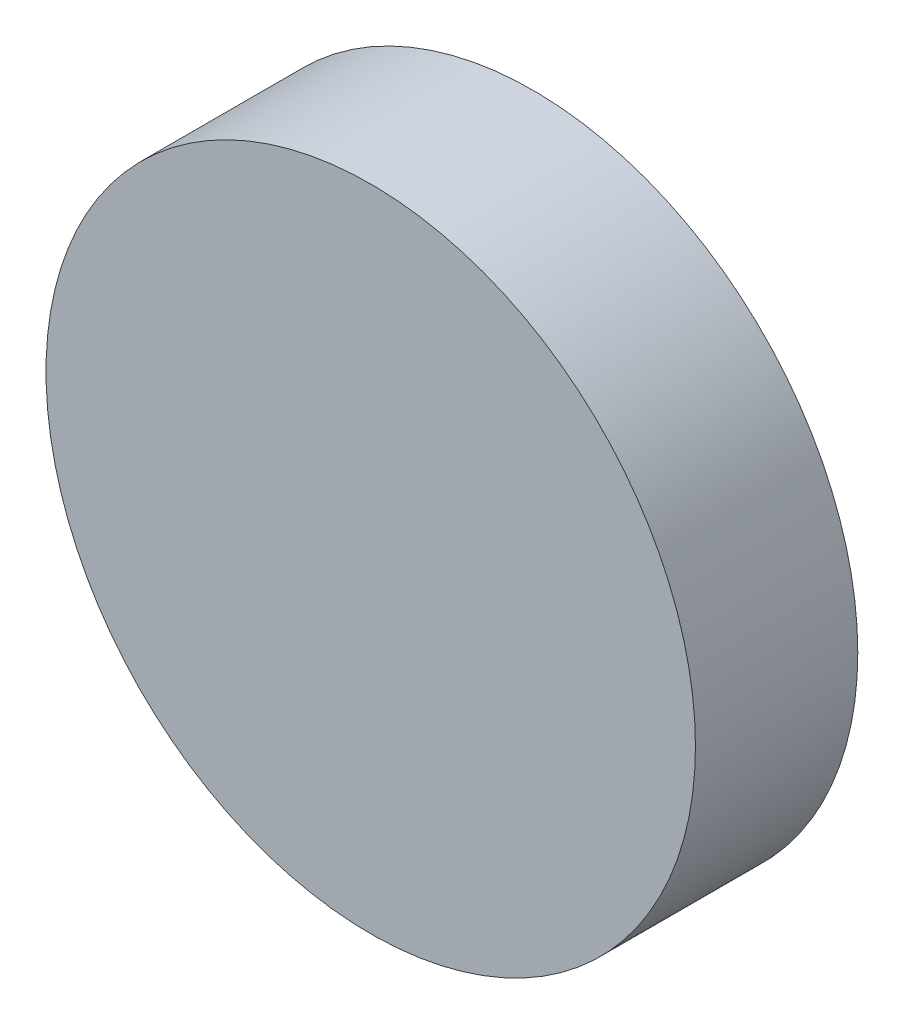
ISO-10303-21;
HEADER;
FILE_DESCRIPTION(('STEP AP214'),'2;1');
FILE_NAME('part.step','',(''),(''),'','','');
FILE_SCHEMA(('AUTOMOTIVE_DESIGN { 1 0 10303 214 1 1 1 1 }'));
ENDSEC;
DATA;
#1=APPLICATION_CONTEXT('core data for automotive mechanical design processes');
#2=APPLICATION_PROTOCOL_DEFINITION('international standard','automotive_design',2000,#1);
#3=PRODUCT_CONTEXT('',#1,'mechanical');
#4=PRODUCT('Part','Part','',(#3));
#5=PRODUCT_RELATED_PRODUCT_CATEGORY('part','',(#4));
#6=PRODUCT_DEFINITION_FORMATION('','',#4);
#7=PRODUCT_DEFINITION_CONTEXT('part definition',#1,'design');
#8=PRODUCT_DEFINITION('design','',#6,#7);
#9=PRODUCT_DEFINITION_SHAPE('','',#8);
#10=(LENGTH_UNIT() NAMED_UNIT(*) SI_UNIT(.MILLI.,.METRE.));
#11=(NAMED_UNIT(*) PLANE_ANGLE_UNIT() SI_UNIT($,.RADIAN.));
#12=(NAMED_UNIT(*) SI_UNIT($,.STERADIAN.) SOLID_ANGLE_UNIT());
#13=UNCERTAINTY_MEASURE_WITH_UNIT(LENGTH_MEASURE(1.E-05),#10,'distance_accuracy_value','');
#14=(GEOMETRIC_REPRESENTATION_CONTEXT(3) GLOBAL_UNCERTAINTY_ASSIGNED_CONTEXT((#13)) GLOBAL_UNIT_ASSIGNED_CONTEXT((#10,
#11,#12)) REPRESENTATION_CONTEXT('',''));
#15=CARTESIAN_POINT('',(0.,0.,0.));
#16=DIRECTION('',(0.,0.,1.));
#17=DIRECTION('',(1.,0.,0.));
#18=AXIS2_PLACEMENT_3D('',#15,#16,#17);
#19=CARTESIAN_POINT('',(0.,0.,0.5));
#20=DIRECTION('',(0.,0.,-1.));
#21=DIRECTION('',(-1.,0.,0.));
#22=AXIS2_PLACEMENT_3D('',#19,#20,#21);
#23=CYLINDRICAL_SURFACE('',#22,2.);
#24=CARTESIAN_POINT('',(0.,0.,0.5));
#25=DIRECTION('',(0.,0.,1.));
#26=DIRECTION('',(1.,0.,0.));
#27=AXIS2_PLACEMENT_3D('',#24,#25,#26);
#28=CIRCLE('',#27,2.);
#29=CARTESIAN_POINT('',(2.,0.,0.5));
#30=VERTEX_POINT('',#29);
#31=EDGE_CURVE('E10',#30,#30,#28,.T.);
#32=ORIENTED_EDGE('',*,*,#31,.F.);
#33=EDGE_LOOP('',(#32));
#34=FACE_BOUND('',#33,.T.);
#35=CARTESIAN_POINT('',(0.,0.,-0.5));
#36=DIRECTION('',(0.,0.,1.));
#37=DIRECTION('',(1.,0.,0.));
#38=AXIS2_PLACEMENT_3D('',#35,#36,#37);
#39=CIRCLE('',#38,2.);
#40=CARTESIAN_POINT('',(2.,0.,-0.5));
#41=VERTEX_POINT('',#40);
#42=EDGE_CURVE('E37',#41,#41,#39,.T.);
#43=ORIENTED_EDGE('',*,*,#42,.T.);
#44=EDGE_LOOP('',(#43));
#45=FACE_BOUND('',#44,.T.);
#46=ADVANCED_FACE('F34',(#34,#45),#23,.T.);
#47=CARTESIAN_POINT('',(0.,0.,0.5));
#48=DIRECTION('',(0.,0.,1.));
#49=DIRECTION('',(1.,0.,0.));
#50=AXIS2_PLACEMENT_3D('',#47,#48,#49);
#51=PLANE('',#50);
#52=ORIENTED_EDGE('',*,*,#31,.T.);
#53=EDGE_LOOP('',(#52));
#54=FACE_BOUND('',#53,.T.);
#55=ADVANCED_FACE('F49',(#54),#51,.T.);
#56=CARTESIAN_POINT('',(0.,0.,-0.5));
#57=DIRECTION('',(0.,0.,1.));
#58=DIRECTION('',(1.,0.,0.));
#59=AXIS2_PLACEMENT_3D('',#56,#57,#58);
#60=PLANE('',#59);
#61=ORIENTED_EDGE('',*,*,#42,.F.);
#62=EDGE_LOOP('',(#61));
#63=FACE_BOUND('',#62,.T.);
#64=ADVANCED_FACE('F47',(#63),#60,.F.);
#65=CLOSED_SHELL('',(#46,#55,#64));
#66=MANIFOLD_SOLID_BREP('B2',#65);
#67=ADVANCED_BREP_SHAPE_REPRESENTATION('',(#18,#66),#14);
#68=SHAPE_DEFINITION_REPRESENTATION(#9,#67);
ENDSEC;
END-ISO-10303-21;
